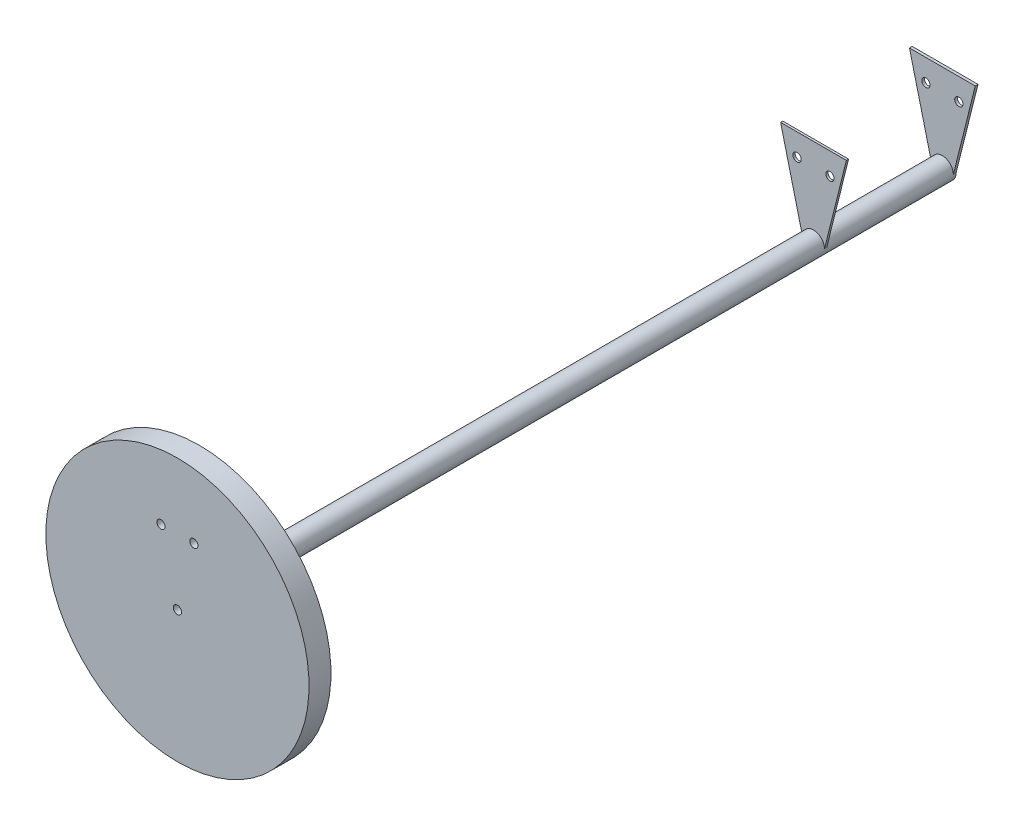
ISO-10303-21;
HEADER;
FILE_DESCRIPTION(('STEP AP214'),'2;1');
FILE_NAME('part.step','',(''),(''),'','','');
FILE_SCHEMA(('AUTOMOTIVE_DESIGN { 1 0 10303 214 1 1 1 1 }'));
ENDSEC;
DATA;
#1=APPLICATION_CONTEXT('core data for automotive mechanical design processes');
#2=APPLICATION_PROTOCOL_DEFINITION('international standard','automotive_design',2000,#1);
#3=PRODUCT_CONTEXT('',#1,'mechanical');
#4=PRODUCT('Part','Part','',(#3));
#5=PRODUCT_RELATED_PRODUCT_CATEGORY('part','',(#4));
#6=PRODUCT_DEFINITION_FORMATION('','',#4);
#7=PRODUCT_DEFINITION_CONTEXT('part definition',#1,'design');
#8=PRODUCT_DEFINITION('design','',#6,#7);
#9=PRODUCT_DEFINITION_SHAPE('','',#8);
#10=(LENGTH_UNIT() NAMED_UNIT(*) SI_UNIT(.MILLI.,.METRE.));
#11=(NAMED_UNIT(*) PLANE_ANGLE_UNIT() SI_UNIT($,.RADIAN.));
#12=(NAMED_UNIT(*) SI_UNIT($,.STERADIAN.) SOLID_ANGLE_UNIT());
#13=UNCERTAINTY_MEASURE_WITH_UNIT(LENGTH_MEASURE(1.E-05),#10,'distance_accuracy_value','');
#14=(GEOMETRIC_REPRESENTATION_CONTEXT(3) GLOBAL_UNCERTAINTY_ASSIGNED_CONTEXT((#13)) GLOBAL_UNIT_ASSIGNED_CONTEXT((#10,
#11,#12)) REPRESENTATION_CONTEXT('',''));
#15=CARTESIAN_POINT('',(0.,0.,0.));
#16=DIRECTION('',(0.,0.,1.));
#17=DIRECTION('',(1.,0.,0.));
#18=AXIS2_PLACEMENT_3D('',#15,#16,#17);
#19=CARTESIAN_POINT('',(0.,0.,444.5));
#20=DIRECTION('',(0.,0.,1.));
#21=DIRECTION('',(0.,-1.,0.));
#22=AXIS2_PLACEMENT_3D('',#19,#20,#21);
#23=CYLINDRICAL_SURFACE('',#22,12.7000000000001);
#24=CARTESIAN_POINT('',(0.,0.,419.1));
#25=DIRECTION('',(0.,0.,1.));
#26=DIRECTION('',(0.,-1.,0.));
#27=AXIS2_PLACEMENT_3D('',#24,#25,#26);
#28=CIRCLE('',#27,12.7000000000002);
#29=CARTESIAN_POINT('',(0.,-12.7000000000002,419.1));
#30=VERTEX_POINT('',#29);
#31=EDGE_CURVE('E197',#30,#30,#28,.T.);
#32=ORIENTED_EDGE('',*,*,#31,.F.);
#33=EDGE_LOOP('',(#32));
#34=FACE_BOUND('',#33,.T.);
#35=CARTESIAN_POINT('',(0.,1.633066506663E-13,-444.5));
#36=DIRECTION('',(0.,0.,1.));
#37=DIRECTION('',(0.,-1.,0.));
#38=AXIS2_PLACEMENT_3D('',#35,#36,#37);
#39=CIRCLE('',#38,12.7);
#40=CARTESIAN_POINT('',(-12.7,0.,-444.5));
#41=VERTEX_POINT('',#40);
#42=CARTESIAN_POINT('',(12.7,0.,-444.5));
#43=VERTEX_POINT('',#42);
#44=EDGE_CURVE('E44',#41,#43,#39,.T.);
#45=ORIENTED_EDGE('',*,*,#44,.T.);
#46=DIRECTION('',(0.,0.,-1.));
#47=VECTOR('',#46,1.);
#48=CARTESIAN_POINT('',(12.7,0.,-441.325));
#49=LINE('',#48,#47);
#50=CARTESIAN_POINT('',(12.7000000000001,0.,-441.325));
#51=VERTEX_POINT('',#50);
#52=EDGE_CURVE('E174',#51,#43,#49,.T.);
#53=ORIENTED_EDGE('',*,*,#52,.F.);
#54=CARTESIAN_POINT('',(0.,1.62723412628206E-13,-441.325));
#55=DIRECTION('',(0.,0.,1.));
#56=DIRECTION('',(1.,0.,0.));
#57=AXIS2_PLACEMENT_3D('',#54,#55,#56);
#58=CIRCLE('',#57,12.7000000000001);
#59=CARTESIAN_POINT('',(-12.7000000000001,3.95950633391706E-13,-441.325));
#60=VERTEX_POINT('',#59);
#61=EDGE_CURVE('E11',#51,#60,#58,.T.);
#62=ORIENTED_EDGE('',*,*,#61,.T.);
#63=DIRECTION('',(0.,0.,-1.));
#64=VECTOR('',#63,1.);
#65=CARTESIAN_POINT('',(-12.7,0.,-441.325));
#66=LINE('',#65,#64);
#67=EDGE_CURVE('E187',#60,#41,#66,.T.);
#68=ORIENTED_EDGE('',*,*,#67,.T.);
#69=EDGE_LOOP('',(#45,#53,#62,#68));
#70=FACE_BOUND('',#69,.T.);
#71=DIRECTION('',(0.,0.,1.));
#72=VECTOR('',#71,1.);
#73=CARTESIAN_POINT('',(-12.7000000000001,2.95279288302753E-13,-294.64));
#74=LINE('',#73,#72);
#75=CARTESIAN_POINT('',(-12.7000000000001,2.95279288302753E-13,-294.64));
#76=VERTEX_POINT('',#75);
#77=CARTESIAN_POINT('',(-12.7000000000001,2.94812697872277E-13,-292.1));
#78=VERTEX_POINT('',#77);
#79=EDGE_CURVE('E52',#76,#78,#74,.T.);
#80=ORIENTED_EDGE('',*,*,#79,.F.);
#81=CARTESIAN_POINT('',(0.,0.,-294.64));
#82=DIRECTION('',(0.,0.,1.));
#83=DIRECTION('',(0.,-1.,0.));
#84=AXIS2_PLACEMENT_3D('',#81,#82,#83);
#85=CIRCLE('',#84,12.7000000000001);
#86=CARTESIAN_POINT('',(12.7000000000001,3.70711524300884E-13,-294.64));
#87=VERTEX_POINT('',#86);
#88=EDGE_CURVE('E107',#87,#76,#85,.T.);
#89=ORIENTED_EDGE('',*,*,#88,.F.);
#90=DIRECTION('',(0.,0.,1.));
#91=VECTOR('',#90,1.);
#92=CARTESIAN_POINT('',(12.7000000000001,3.70711524300884E-13,-294.64));
#93=LINE('',#92,#91);
#94=CARTESIAN_POINT('',(12.7000000000001,3.80774596688509E-13,-292.1));
#95=VERTEX_POINT('',#94);
#96=EDGE_CURVE('E123',#87,#95,#93,.T.);
#97=ORIENTED_EDGE('',*,*,#96,.T.);
#98=CARTESIAN_POINT('',(0.,0.,-292.1));
#99=DIRECTION('',(0.,0.,1.));
#100=DIRECTION('',(0.,-1.,0.));
#101=AXIS2_PLACEMENT_3D('',#98,#99,#100);
#102=CIRCLE('',#101,12.7000000000001);
#103=EDGE_CURVE('E57',#95,#78,#102,.T.);
#104=ORIENTED_EDGE('',*,*,#103,.T.);
#105=EDGE_LOOP('',(#80,#89,#97,#104));
#106=FACE_BOUND('',#105,.T.);
#107=ADVANCED_FACE('F35',(#34,#70,#106),#23,.T.);
#108=CARTESIAN_POINT('',(0.,12.7000000000002,-444.5));
#109=DIRECTION('',(0.,0.,1.));
#110=DIRECTION('',(0.,-1.,0.));
#111=AXIS2_PLACEMENT_3D('',#108,#109,#110);
#112=PLANE('',#111);
#113=CARTESIAN_POINT('',(19.05,76.2000000000001,-444.5));
#114=DIRECTION('',(0.,0.,-1.));
#115=DIRECTION('',(0.,1.,0.));
#116=AXIS2_PLACEMENT_3D('',#113,#114,#115);
#117=CIRCLE('',#116,4.7625);
#118=CARTESIAN_POINT('',(19.05,80.9625000000001,-444.5));
#119=VERTEX_POINT('',#118);
#120=EDGE_CURVE('E143',#119,#119,#117,.T.);
#121=ORIENTED_EDGE('',*,*,#120,.F.);
#122=EDGE_LOOP('',(#121));
#123=FACE_BOUND('',#122,.T.);
#124=CARTESIAN_POINT('',(-19.05,76.2000000000001,-444.5));
#125=DIRECTION('',(0.,0.,-1.));
#126=DIRECTION('',(0.,-1.,0.));
#127=AXIS2_PLACEMENT_3D('',#124,#125,#126);
#128=CIRCLE('',#127,4.7625);
#129=CARTESIAN_POINT('',(-19.05,71.4375000000001,-444.5));
#130=VERTEX_POINT('',#129);
#131=EDGE_CURVE('E149',#130,#130,#128,.T.);
#132=ORIENTED_EDGE('',*,*,#131,.F.);
#133=EDGE_LOOP('',(#132));
#134=FACE_BOUND('',#133,.T.);
#135=CARTESIAN_POINT('',(0.,0.,-444.5));
#136=DIRECTION('',(0.,0.,-1.));
#137=DIRECTION('',(0.,1.,0.));
#138=AXIS2_PLACEMENT_3D('',#135,#136,#137);
#139=CIRCLE('',#138,4.7625);
#140=CARTESIAN_POINT('',(0.,4.76250000000008,-444.5));
#141=VERTEX_POINT('',#140);
#142=EDGE_CURVE('E138',#141,#141,#139,.T.);
#143=ORIENTED_EDGE('',*,*,#142,.F.);
#144=EDGE_LOOP('',(#143));
#145=FACE_BOUND('',#144,.T.);
#146=ORIENTED_EDGE('',*,*,#44,.F.);
#147=DIRECTION('',(-0.242535625036333,0.970142500145332,0.));
#148=VECTOR('',#147,1.);
#149=CARTESIAN_POINT('',(-12.7,0.,-444.5));
#150=LINE('',#149,#148);
#151=CARTESIAN_POINT('',(-38.1,101.6,-444.5));
#152=VERTEX_POINT('',#151);
#153=EDGE_CURVE('E177',#41,#152,#150,.T.);
#154=ORIENTED_EDGE('',*,*,#153,.T.);
#155=DIRECTION('',(1.,0.,0.));
#156=VECTOR('',#155,1.);
#157=CARTESIAN_POINT('',(38.1,101.6,-444.5));
#158=LINE('',#157,#156);
#159=CARTESIAN_POINT('',(38.1,101.6,-444.5));
#160=VERTEX_POINT('',#159);
#161=EDGE_CURVE('E168',#152,#160,#158,.T.);
#162=ORIENTED_EDGE('',*,*,#161,.T.);
#163=DIRECTION('',(-0.242535625036333,-0.970142500145332,0.));
#164=VECTOR('',#163,1.);
#165=CARTESIAN_POINT('',(12.7,0.,-444.5));
#166=LINE('',#165,#164);
#167=EDGE_CURVE('E163',#160,#43,#166,.T.);
#168=ORIENTED_EDGE('',*,*,#167,.T.);
#169=EDGE_LOOP('',(#146,#154,#162,#168));
#170=FACE_BOUND('',#169,.T.);
#171=ADVANCED_FACE('F37',(#123,#134,#145,#170),#112,.F.);
#172=CARTESIAN_POINT('',(0.,152.4,419.1));
#173=DIRECTION('',(0.,0.,1.));
#174=DIRECTION('',(0.,-1.,0.));
#175=AXIS2_PLACEMENT_3D('',#172,#173,#174);
#176=PLANE('',#175);
#177=CARTESIAN_POINT('',(19.05,76.1999999999999,419.1));
#178=DIRECTION('',(0.,0.,1.));
#179=DIRECTION('',(0.,-1.,0.));
#180=AXIS2_PLACEMENT_3D('',#177,#178,#179);
#181=CIRCLE('',#180,4.7625);
#182=CARTESIAN_POINT('',(19.05,71.4374999999999,419.1));
#183=VERTEX_POINT('',#182);
#184=EDGE_CURVE('E160',#183,#183,#181,.T.);
#185=ORIENTED_EDGE('',*,*,#184,.T.);
#186=EDGE_LOOP('',(#185));
#187=FACE_BOUND('',#186,.T.);
#188=CARTESIAN_POINT('',(-19.05,76.1999999999999,419.1));
#189=DIRECTION('',(0.,0.,1.));
#190=DIRECTION('',(0.,-1.,0.));
#191=AXIS2_PLACEMENT_3D('',#188,#189,#190);
#192=CIRCLE('',#191,4.7625);
#193=CARTESIAN_POINT('',(-19.05,71.4374999999999,419.1));
#194=VERTEX_POINT('',#193);
#195=EDGE_CURVE('E157',#194,#194,#192,.T.);
#196=ORIENTED_EDGE('',*,*,#195,.T.);
#197=EDGE_LOOP('',(#196));
#198=FACE_BOUND('',#197,.T.);
#199=CARTESIAN_POINT('',(0.,0.,419.1));
#200=DIRECTION('',(0.,0.,1.));
#201=DIRECTION('',(0.,-1.,0.));
#202=AXIS2_PLACEMENT_3D('',#199,#200,#201);
#203=CIRCLE('',#202,152.4);
#204=CARTESIAN_POINT('',(0.,-152.4,419.1));
#205=VERTEX_POINT('',#204);
#206=EDGE_CURVE('E194',#205,#205,#203,.T.);
#207=ORIENTED_EDGE('',*,*,#206,.F.);
#208=EDGE_LOOP('',(#207));
#209=FACE_BOUND('',#208,.T.);
#210=ORIENTED_EDGE('',*,*,#31,.T.);
#211=EDGE_LOOP('',(#210));
#212=FACE_BOUND('',#211,.T.);
#213=ADVANCED_FACE('F228',(#187,#198,#209,#212),#176,.F.);
#214=CARTESIAN_POINT('',(0.,0.,444.5));
#215=DIRECTION('',(0.,0.,1.));
#216=DIRECTION('',(0.,-1.,0.));
#217=AXIS2_PLACEMENT_3D('',#214,#215,#216);
#218=CYLINDRICAL_SURFACE('',#217,152.4);
#219=CARTESIAN_POINT('',(0.,0.,444.5));
#220=DIRECTION('',(0.,0.,1.));
#221=DIRECTION('',(0.,-1.,0.));
#222=AXIS2_PLACEMENT_3D('',#219,#220,#221);
#223=CIRCLE('',#222,152.4);
#224=CARTESIAN_POINT('',(0.,-152.4,444.5));
#225=VERTEX_POINT('',#224);
#226=EDGE_CURVE('E184',#225,#225,#223,.T.);
#227=ORIENTED_EDGE('',*,*,#226,.F.);
#228=EDGE_LOOP('',(#227));
#229=FACE_BOUND('',#228,.T.);
#230=ORIENTED_EDGE('',*,*,#206,.T.);
#231=EDGE_LOOP('',(#230));
#232=FACE_BOUND('',#231,.T.);
#233=ADVANCED_FACE('F234',(#229,#232),#218,.T.);
#234=CARTESIAN_POINT('',(0.,0.,444.5));
#235=DIRECTION('',(0.,0.,-1.));
#236=DIRECTION('',(0.,1.,0.));
#237=AXIS2_PLACEMENT_3D('',#234,#235,#236);
#238=PLANE('',#237);
#239=CARTESIAN_POINT('',(19.05,76.1999999999999,444.5));
#240=DIRECTION('',(0.,0.,-1.));
#241=DIRECTION('',(0.,1.,0.));
#242=AXIS2_PLACEMENT_3D('',#239,#240,#241);
#243=CIRCLE('',#242,4.7625);
#244=CARTESIAN_POINT('',(19.05,80.9624999999999,444.5));
#245=VERTEX_POINT('',#244);
#246=EDGE_CURVE('E139',#245,#245,#243,.T.);
#247=ORIENTED_EDGE('',*,*,#246,.T.);
#248=EDGE_LOOP('',(#247));
#249=FACE_BOUND('',#248,.T.);
#250=CARTESIAN_POINT('',(-19.05,76.1999999999999,444.5));
#251=DIRECTION('',(0.,0.,-1.));
#252=DIRECTION('',(0.,-1.,0.));
#253=AXIS2_PLACEMENT_3D('',#250,#251,#252);
#254=CIRCLE('',#253,4.7625);
#255=CARTESIAN_POINT('',(-19.05,71.4374999999999,444.5));
#256=VERTEX_POINT('',#255);
#257=EDGE_CURVE('E146',#256,#256,#254,.T.);
#258=ORIENTED_EDGE('',*,*,#257,.T.);
#259=EDGE_LOOP('',(#258));
#260=FACE_BOUND('',#259,.T.);
#261=CARTESIAN_POINT('',(0.,0.,444.5));
#262=DIRECTION('',(0.,0.,-1.));
#263=DIRECTION('',(0.,1.,0.));
#264=AXIS2_PLACEMENT_3D('',#261,#262,#263);
#265=CIRCLE('',#264,4.7625);
#266=CARTESIAN_POINT('',(0.,4.76249999999992,444.5));
#267=VERTEX_POINT('',#266);
#268=EDGE_CURVE('E152',#267,#267,#265,.T.);
#269=ORIENTED_EDGE('',*,*,#268,.T.);
#270=EDGE_LOOP('',(#269));
#271=FACE_BOUND('',#270,.T.);
#272=ORIENTED_EDGE('',*,*,#226,.T.);
#273=EDGE_LOOP('',(#272));
#274=FACE_BOUND('',#273,.T.);
#275=ADVANCED_FACE('F267',(#249,#260,#271,#274),#238,.F.);
#276=CARTESIAN_POINT('',(12.7,0.,-441.325));
#277=DIRECTION('',(0.970142500145332,-0.242535625036333,0.));
#278=DIRECTION('',(0.242535625036333,0.970142500145332,0.));
#279=AXIS2_PLACEMENT_3D('',#276,#277,#278);
#280=PLANE('',#279);
#281=ORIENTED_EDGE('',*,*,#167,.F.);
#282=DIRECTION('',(0.,0.,-1.));
#283=VECTOR('',#282,1.);
#284=CARTESIAN_POINT('',(38.1,101.6,-441.325));
#285=LINE('',#284,#283);
#286=CARTESIAN_POINT('',(38.1,101.6,-441.325));
#287=VERTEX_POINT('',#286);
#288=EDGE_CURVE('E182',#287,#160,#285,.T.);
#289=ORIENTED_EDGE('',*,*,#288,.F.);
#290=DIRECTION('',(-0.242535625036333,-0.970142500145332,0.));
#291=VECTOR('',#290,1.);
#292=CARTESIAN_POINT('',(12.7,0.,-441.325));
#293=LINE('',#292,#291);
#294=EDGE_CURVE('E164',#287,#51,#293,.T.);
#295=ORIENTED_EDGE('',*,*,#294,.T.);
#296=ORIENTED_EDGE('',*,*,#52,.T.);
#297=EDGE_LOOP('',(#281,#289,#295,#296));
#298=FACE_BOUND('',#297,.T.);
#299=ADVANCED_FACE('F220',(#298),#280,.T.);
#300=CARTESIAN_POINT('',(38.1,101.6,-441.325));
#301=DIRECTION('',(0.,1.,0.));
#302=DIRECTION('',(0.,0.,1.));
#303=AXIS2_PLACEMENT_3D('',#300,#301,#302);
#304=PLANE('',#303);
#305=ORIENTED_EDGE('',*,*,#161,.F.);
#306=DIRECTION('',(0.,0.,-1.));
#307=VECTOR('',#306,1.);
#308=CARTESIAN_POINT('',(-38.1,101.6,-441.325));
#309=LINE('',#308,#307);
#310=CARTESIAN_POINT('',(-38.1,101.6,-441.325));
#311=VERTEX_POINT('',#310);
#312=EDGE_CURVE('E185',#311,#152,#309,.T.);
#313=ORIENTED_EDGE('',*,*,#312,.F.);
#314=DIRECTION('',(1.,0.,0.));
#315=VECTOR('',#314,1.);
#316=CARTESIAN_POINT('',(38.1,101.6,-441.325));
#317=LINE('',#316,#315);
#318=EDGE_CURVE('E171',#311,#287,#317,.T.);
#319=ORIENTED_EDGE('',*,*,#318,.T.);
#320=ORIENTED_EDGE('',*,*,#288,.T.);
#321=EDGE_LOOP('',(#305,#313,#319,#320));
#322=FACE_BOUND('',#321,.T.);
#323=ADVANCED_FACE('F223',(#322),#304,.T.);
#324=CARTESIAN_POINT('',(-12.7,0.,-441.325));
#325=DIRECTION('',(-0.970142500145332,-0.242535625036333,0.));
#326=DIRECTION('',(0.242535625036333,-0.970142500145332,0.));
#327=AXIS2_PLACEMENT_3D('',#324,#325,#326);
#328=PLANE('',#327);
#329=ORIENTED_EDGE('',*,*,#153,.F.);
#330=ORIENTED_EDGE('',*,*,#67,.F.);
#331=DIRECTION('',(-0.242535625036333,0.970142500145332,0.));
#332=VECTOR('',#331,1.);
#333=CARTESIAN_POINT('',(-12.7,0.,-441.325));
#334=LINE('',#333,#332);
#335=EDGE_CURVE('E167',#60,#311,#334,.T.);
#336=ORIENTED_EDGE('',*,*,#335,.T.);
#337=ORIENTED_EDGE('',*,*,#312,.T.);
#338=EDGE_LOOP('',(#329,#330,#336,#337));
#339=FACE_BOUND('',#338,.T.);
#340=ADVANCED_FACE('F209',(#339),#328,.T.);
#341=CARTESIAN_POINT('',(0.,0.,-441.325));
#342=DIRECTION('',(0.,0.,1.));
#343=DIRECTION('',(1.,0.,0.));
#344=AXIS2_PLACEMENT_3D('',#341,#342,#343);
#345=PLANE('',#344);
#346=CARTESIAN_POINT('',(19.05,76.2000000000001,-441.325));
#347=DIRECTION('',(0.,0.,1.));
#348=DIRECTION('',(1.,0.,0.));
#349=AXIS2_PLACEMENT_3D('',#346,#347,#348);
#350=CIRCLE('',#349,4.7625);
#351=CARTESIAN_POINT('',(23.8125,76.2000000000001,-441.325));
#352=VERTEX_POINT('',#351);
#353=EDGE_CURVE('E39',#352,#352,#350,.T.);
#354=ORIENTED_EDGE('',*,*,#353,.F.);
#355=EDGE_LOOP('',(#354));
#356=FACE_BOUND('',#355,.T.);
#357=CARTESIAN_POINT('',(-19.05,76.2000000000001,-441.325));
#358=DIRECTION('',(0.,0.,1.));
#359=DIRECTION('',(1.,0.,0.));
#360=AXIS2_PLACEMENT_3D('',#357,#358,#359);
#361=CIRCLE('',#360,4.7625);
#362=CARTESIAN_POINT('',(-14.2875,76.2000000000001,-441.325));
#363=VERTEX_POINT('',#362);
#364=EDGE_CURVE('E142',#363,#363,#361,.T.);
#365=ORIENTED_EDGE('',*,*,#364,.F.);
#366=EDGE_LOOP('',(#365));
#367=FACE_BOUND('',#366,.T.);
#368=ORIENTED_EDGE('',*,*,#61,.F.);
#369=ORIENTED_EDGE('',*,*,#294,.F.);
#370=ORIENTED_EDGE('',*,*,#318,.F.);
#371=ORIENTED_EDGE('',*,*,#335,.F.);
#372=EDGE_LOOP('',(#368,#369,#370,#371));
#373=FACE_BOUND('',#372,.T.);
#374=ADVANCED_FACE('F206',(#356,#367,#373),#345,.T.);
#375=CARTESIAN_POINT('',(-19.05,76.1999999999999,444.5));
#376=DIRECTION('',(0.,0.,-1.));
#377=DIRECTION('',(0.,1.,0.));
#378=AXIS2_PLACEMENT_3D('',#375,#376,#377);
#379=CYLINDRICAL_SURFACE('',#378,4.7625);
#380=ORIENTED_EDGE('',*,*,#364,.T.);
#381=EDGE_LOOP('',(#380));
#382=FACE_BOUND('',#381,.T.);
#383=ORIENTED_EDGE('',*,*,#131,.T.);
#384=EDGE_LOOP('',(#383));
#385=FACE_BOUND('',#384,.T.);
#386=ADVANCED_FACE('F203',(#382,#385),#379,.F.);
#387=CARTESIAN_POINT('',(19.05,76.1999999999999,444.5));
#388=DIRECTION('',(0.,0.,-1.));
#389=DIRECTION('',(0.,1.,0.));
#390=AXIS2_PLACEMENT_3D('',#387,#388,#389);
#391=CYLINDRICAL_SURFACE('',#390,4.7625);
#392=ORIENTED_EDGE('',*,*,#353,.T.);
#393=EDGE_LOOP('',(#392));
#394=FACE_BOUND('',#393,.T.);
#395=ORIENTED_EDGE('',*,*,#120,.T.);
#396=EDGE_LOOP('',(#395));
#397=FACE_BOUND('',#396,.T.);
#398=ADVANCED_FACE('F247',(#394,#397),#391,.F.);
#399=CARTESIAN_POINT('',(0.,0.,444.5));
#400=DIRECTION('',(0.,0.,-1.));
#401=DIRECTION('',(0.,1.,0.));
#402=AXIS2_PLACEMENT_3D('',#399,#400,#401);
#403=CYLINDRICAL_SURFACE('',#402,4.7625);
#404=ORIENTED_EDGE('',*,*,#268,.F.);
#405=EDGE_LOOP('',(#404));
#406=FACE_BOUND('',#405,.T.);
#407=ORIENTED_EDGE('',*,*,#142,.T.);
#408=EDGE_LOOP('',(#407));
#409=FACE_BOUND('',#408,.T.);
#410=ADVANCED_FACE('F244',(#406,#409),#403,.F.);
#411=ORIENTED_EDGE('',*,*,#257,.F.);
#412=EDGE_LOOP('',(#411));
#413=FACE_BOUND('',#412,.T.);
#414=ORIENTED_EDGE('',*,*,#195,.F.);
#415=EDGE_LOOP('',(#414));
#416=FACE_BOUND('',#415,.T.);
#417=ADVANCED_FACE('F246',(#413,#416),#379,.F.);
#418=ORIENTED_EDGE('',*,*,#246,.F.);
#419=EDGE_LOOP('',(#418));
#420=FACE_BOUND('',#419,.T.);
#421=ORIENTED_EDGE('',*,*,#184,.F.);
#422=EDGE_LOOP('',(#421));
#423=FACE_BOUND('',#422,.T.);
#424=ADVANCED_FACE('F254',(#420,#423),#391,.F.);
#425=CARTESIAN_POINT('',(0.,0.,-294.64));
#426=DIRECTION('',(0.,0.,1.));
#427=DIRECTION('',(0.,-1.,0.));
#428=AXIS2_PLACEMENT_3D('',#425,#426,#427);
#429=PLANE('',#428);
#430=ORIENTED_EDGE('',*,*,#88,.T.);
#431=DIRECTION('',(-0.242535625036333,0.970142500145332,0.));
#432=VECTOR('',#431,1.);
#433=CARTESIAN_POINT('',(-12.7000000000001,2.95279288302753E-13,-294.64));
#434=LINE('',#433,#432);
#435=CARTESIAN_POINT('',(-38.1,101.6,-294.64));
#436=VERTEX_POINT('',#435);
#437=EDGE_CURVE('E99',#76,#436,#434,.T.);
#438=ORIENTED_EDGE('',*,*,#437,.T.);
#439=DIRECTION('',(1.,0.,0.));
#440=VECTOR('',#439,1.);
#441=CARTESIAN_POINT('',(-38.1,101.6,-294.64));
#442=LINE('',#441,#440);
#443=CARTESIAN_POINT('',(38.1,101.6,-294.64));
#444=VERTEX_POINT('',#443);
#445=EDGE_CURVE('E105',#436,#444,#442,.T.);
#446=ORIENTED_EDGE('',*,*,#445,.T.);
#447=DIRECTION('',(-0.242535625036333,-0.970142500145332,0.));
#448=VECTOR('',#447,1.);
#449=CARTESIAN_POINT('',(38.1,101.6,-294.64));
#450=LINE('',#449,#448);
#451=EDGE_CURVE('E121',#444,#87,#450,.T.);
#452=ORIENTED_EDGE('',*,*,#451,.T.);
#453=EDGE_LOOP('',(#430,#438,#446,#452));
#454=FACE_BOUND('',#453,.T.);
#455=CARTESIAN_POINT('',(-19.05,76.2000000000001,-294.64));
#456=DIRECTION('',(0.,0.,-1.));
#457=DIRECTION('',(0.,1.,0.));
#458=AXIS2_PLACEMENT_3D('',#455,#456,#457);
#459=CIRCLE('',#458,4.76250000000002);
#460=CARTESIAN_POINT('',(-19.05,80.9625000000001,-294.64));
#461=VERTEX_POINT('',#460);
#462=EDGE_CURVE('E128',#461,#461,#459,.T.);
#463=ORIENTED_EDGE('',*,*,#462,.F.);
#464=EDGE_LOOP('',(#463));
#465=FACE_BOUND('',#464,.T.);
#466=CARTESIAN_POINT('',(19.05,76.2000000000001,-294.64));
#467=DIRECTION('',(0.,0.,-1.));
#468=DIRECTION('',(0.,1.,0.));
#469=AXIS2_PLACEMENT_3D('',#466,#467,#468);
#470=CIRCLE('',#469,4.7625);
#471=CARTESIAN_POINT('',(19.05,80.9625000000001,-294.64));
#472=VERTEX_POINT('',#471);
#473=EDGE_CURVE('E408',#472,#472,#470,.T.);
#474=ORIENTED_EDGE('',*,*,#473,.F.);
#475=EDGE_LOOP('',(#474));
#476=FACE_BOUND('',#475,.T.);
#477=ADVANCED_FACE('F101',(#454,#465,#476),#429,.F.);
#478=CARTESIAN_POINT('',(0.,0.,-292.1));
#479=DIRECTION('',(0.,0.,1.));
#480=DIRECTION('',(0.,-1.,0.));
#481=AXIS2_PLACEMENT_3D('',#478,#479,#480);
#482=PLANE('',#481);
#483=CARTESIAN_POINT('',(-19.05,76.2000000000001,-292.1));
#484=DIRECTION('',(0.,0.,-1.));
#485=DIRECTION('',(0.,1.,0.));
#486=AXIS2_PLACEMENT_3D('',#483,#484,#485);
#487=CIRCLE('',#486,4.76250000000002);
#488=CARTESIAN_POINT('',(-19.05,80.9625000000001,-292.1));
#489=VERTEX_POINT('',#488);
#490=EDGE_CURVE('E414',#489,#489,#487,.T.);
#491=ORIENTED_EDGE('',*,*,#490,.T.);
#492=EDGE_LOOP('',(#491));
#493=FACE_BOUND('',#492,.T.);
#494=ORIENTED_EDGE('',*,*,#103,.F.);
#495=DIRECTION('',(-0.242535625036333,-0.970142500145332,0.));
#496=VECTOR('',#495,1.);
#497=CARTESIAN_POINT('',(38.1,101.6,-292.1));
#498=LINE('',#497,#496);
#499=CARTESIAN_POINT('',(38.1,101.6,-292.1));
#500=VERTEX_POINT('',#499);
#501=EDGE_CURVE('E132',#500,#95,#498,.T.);
#502=ORIENTED_EDGE('',*,*,#501,.F.);
#503=DIRECTION('',(1.,0.,0.));
#504=VECTOR('',#503,1.);
#505=CARTESIAN_POINT('',(-38.1,101.6,-292.1));
#506=LINE('',#505,#504);
#507=CARTESIAN_POINT('',(-38.1,101.6,-292.1));
#508=VERTEX_POINT('',#507);
#509=EDGE_CURVE('E130',#508,#500,#506,.T.);
#510=ORIENTED_EDGE('',*,*,#509,.F.);
#511=DIRECTION('',(-0.242535625036333,0.970142500145332,0.));
#512=VECTOR('',#511,1.);
#513=CARTESIAN_POINT('',(-12.7000000000001,2.94812697872277E-13,-292.1));
#514=LINE('',#513,#512);
#515=EDGE_CURVE('E113',#78,#508,#514,.T.);
#516=ORIENTED_EDGE('',*,*,#515,.F.);
#517=EDGE_LOOP('',(#494,#502,#510,#516));
#518=FACE_BOUND('',#517,.T.);
#519=CARTESIAN_POINT('',(19.05,76.2000000000001,-292.1));
#520=DIRECTION('',(0.,0.,-1.));
#521=DIRECTION('',(0.,1.,0.));
#522=AXIS2_PLACEMENT_3D('',#519,#520,#521);
#523=CIRCLE('',#522,4.7625);
#524=CARTESIAN_POINT('',(19.05,80.9625000000001,-292.1));
#525=VERTEX_POINT('',#524);
#526=EDGE_CURVE('E411',#525,#525,#523,.T.);
#527=ORIENTED_EDGE('',*,*,#526,.T.);
#528=EDGE_LOOP('',(#527));
#529=FACE_BOUND('',#528,.T.);
#530=ADVANCED_FACE('F346',(#493,#518,#529),#482,.T.);
#531=CARTESIAN_POINT('',(-12.7000000000001,2.95279288302753E-13,-294.64));
#532=DIRECTION('',(0.970142500145332,0.242535625036333,0.));
#533=DIRECTION('',(-0.242535625036333,0.970142500145332,0.));
#534=AXIS2_PLACEMENT_3D('',#531,#532,#533);
#535=PLANE('',#534);
#536=ORIENTED_EDGE('',*,*,#515,.T.);
#537=DIRECTION('',(0.,0.,1.));
#538=VECTOR('',#537,1.);
#539=CARTESIAN_POINT('',(-38.1,101.6,-294.64));
#540=LINE('',#539,#538);
#541=EDGE_CURVE('E111',#436,#508,#540,.T.);
#542=ORIENTED_EDGE('',*,*,#541,.F.);
#543=ORIENTED_EDGE('',*,*,#437,.F.);
#544=ORIENTED_EDGE('',*,*,#79,.T.);
#545=EDGE_LOOP('',(#536,#542,#543,#544));
#546=FACE_BOUND('',#545,.T.);
#547=ADVANCED_FACE('F112',(#546),#535,.F.);
#548=CARTESIAN_POINT('',(-38.1,101.6,-294.64));
#549=DIRECTION('',(0.,-1.,0.));
#550=DIRECTION('',(0.,0.,-1.));
#551=AXIS2_PLACEMENT_3D('',#548,#549,#550);
#552=PLANE('',#551);
#553=ORIENTED_EDGE('',*,*,#509,.T.);
#554=DIRECTION('',(0.,0.,1.));
#555=VECTOR('',#554,1.);
#556=CARTESIAN_POINT('',(38.1,101.6,-294.64));
#557=LINE('',#556,#555);
#558=EDGE_CURVE('E116',#444,#500,#557,.T.);
#559=ORIENTED_EDGE('',*,*,#558,.F.);
#560=ORIENTED_EDGE('',*,*,#445,.F.);
#561=ORIENTED_EDGE('',*,*,#541,.T.);
#562=EDGE_LOOP('',(#553,#559,#560,#561));
#563=FACE_BOUND('',#562,.T.);
#564=ADVANCED_FACE('F118',(#563),#552,.F.);
#565=CARTESIAN_POINT('',(38.1,101.6,-294.64));
#566=DIRECTION('',(-0.970142500145332,0.242535625036333,0.));
#567=DIRECTION('',(-0.242535625036333,-0.970142500145332,0.));
#568=AXIS2_PLACEMENT_3D('',#565,#566,#567);
#569=PLANE('',#568);
#570=ORIENTED_EDGE('',*,*,#501,.T.);
#571=ORIENTED_EDGE('',*,*,#96,.F.);
#572=ORIENTED_EDGE('',*,*,#451,.F.);
#573=ORIENTED_EDGE('',*,*,#558,.T.);
#574=EDGE_LOOP('',(#570,#571,#572,#573));
#575=FACE_BOUND('',#574,.T.);
#576=ADVANCED_FACE('F372',(#575),#569,.F.);
#577=CARTESIAN_POINT('',(-19.05,76.2000000000001,-294.64));
#578=DIRECTION('',(0.,0.,1.));
#579=DIRECTION('',(0.,-1.,0.));
#580=AXIS2_PLACEMENT_3D('',#577,#578,#579);
#581=CYLINDRICAL_SURFACE('',#580,4.76250000000002);
#582=ORIENTED_EDGE('',*,*,#462,.T.);
#583=EDGE_LOOP('',(#582));
#584=FACE_BOUND('',#583,.T.);
#585=ORIENTED_EDGE('',*,*,#490,.F.);
#586=EDGE_LOOP('',(#585));
#587=FACE_BOUND('',#586,.T.);
#588=ADVANCED_FACE('F381',(#584,#587),#581,.F.);
#589=CARTESIAN_POINT('',(19.05,76.2000000000001,-294.64));
#590=DIRECTION('',(0.,0.,1.));
#591=DIRECTION('',(0.,-1.,0.));
#592=AXIS2_PLACEMENT_3D('',#589,#590,#591);
#593=CYLINDRICAL_SURFACE('',#592,4.7625);
#594=ORIENTED_EDGE('',*,*,#473,.T.);
#595=EDGE_LOOP('',(#594));
#596=FACE_BOUND('',#595,.T.);
#597=ORIENTED_EDGE('',*,*,#526,.F.);
#598=EDGE_LOOP('',(#597));
#599=FACE_BOUND('',#598,.T.);
#600=ADVANCED_FACE('F391',(#596,#599),#593,.F.);
#601=CLOSED_SHELL('',(#107,#171,#213,#233,#275,#299,#323,#340,#374,#386,#398,#410,#417,#424,
#477,#530,#547,#564,#576,#588,#600));
#602=MANIFOLD_SOLID_BREP('B2',#601);
#603=ADVANCED_BREP_SHAPE_REPRESENTATION('',(#18,#602),#14);
#604=SHAPE_DEFINITION_REPRESENTATION(#9,#603);
ENDSEC;
END-ISO-10303-21;
